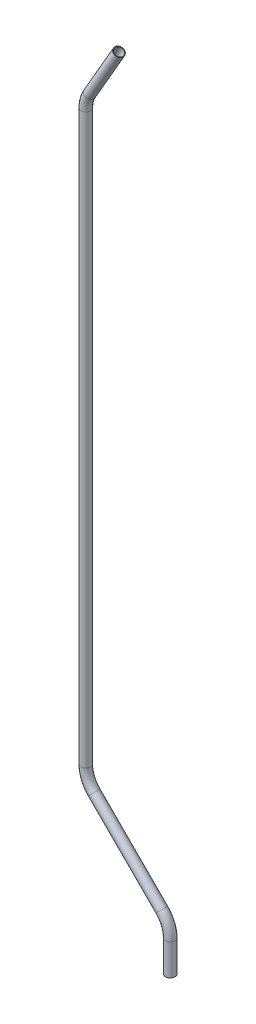
ISO-10303-21;
HEADER;
FILE_DESCRIPTION(('STEP AP214'),'2;1');
FILE_NAME('part.step','',(''),(''),'','','');
FILE_SCHEMA(('AUTOMOTIVE_DESIGN { 1 0 10303 214 1 1 1 1 }'));
ENDSEC;
DATA;
#1=APPLICATION_CONTEXT('core data for automotive mechanical design processes');
#2=APPLICATION_PROTOCOL_DEFINITION('international standard','automotive_design',2000,#1);
#3=PRODUCT_CONTEXT('',#1,'mechanical');
#4=PRODUCT('Part','Part','',(#3));
#5=PRODUCT_RELATED_PRODUCT_CATEGORY('part','',(#4));
#6=PRODUCT_DEFINITION_FORMATION('','',#4);
#7=PRODUCT_DEFINITION_CONTEXT('part definition',#1,'design');
#8=PRODUCT_DEFINITION('design','',#6,#7);
#9=PRODUCT_DEFINITION_SHAPE('','',#8);
#10=(LENGTH_UNIT() NAMED_UNIT(*) SI_UNIT(.MILLI.,.METRE.));
#11=(NAMED_UNIT(*) PLANE_ANGLE_UNIT() SI_UNIT($,.RADIAN.));
#12=(NAMED_UNIT(*) SI_UNIT($,.STERADIAN.) SOLID_ANGLE_UNIT());
#13=UNCERTAINTY_MEASURE_WITH_UNIT(LENGTH_MEASURE(1.E-05),#10,'distance_accuracy_value','');
#14=(GEOMETRIC_REPRESENTATION_CONTEXT(3) GLOBAL_UNCERTAINTY_ASSIGNED_CONTEXT((#13)) GLOBAL_UNIT_ASSIGNED_CONTEXT((#10,
#11,#12)) REPRESENTATION_CONTEXT('',''));
#15=CARTESIAN_POINT('',(0.,0.,0.));
#16=DIRECTION('',(0.,0.,1.));
#17=DIRECTION('',(1.,0.,0.));
#18=AXIS2_PLACEMENT_3D('',#15,#16,#17);
#19=CARTESIAN_POINT('',(-67.7659094877504,769.253486726415,0.));
#20=DIRECTION('',(-0.500000000000001,-0.866025403784438,0.));
#21=DIRECTION('',(0.866025403784438,-0.500000000000001,0.));
#22=AXIS2_PLACEMENT_3D('',#19,#20,#21);
#23=CYLINDRICAL_SURFACE('',#22,6.35);
#24=CARTESIAN_POINT('',(-106.655567884187,701.89462249479,0.));
#25=DIRECTION('',(0.500000000000001,0.866025403784438,0.));
#26=DIRECTION('',(0.,0.,1.));
#27=AXIS2_PLACEMENT_3D('',#24,#25,#26);
#28=CIRCLE('',#27,6.35);
#29=CARTESIAN_POINT('',(-112.154829198218,705.06962249479,0.));
#30=VERTEX_POINT('',#29);
#31=EDGE_CURVE('E65',#30,#30,#28,.T.);
#32=ORIENTED_EDGE('',*,*,#31,.T.);
#33=EDGE_LOOP('',(#32));
#34=FACE_BOUND('',#33,.T.);
#35=CARTESIAN_POINT('',(-67.7659094877504,769.253486726415,0.));
#36=DIRECTION('',(0.500000000000001,0.866025403784438,0.));
#37=DIRECTION('',(0.,0.,1.));
#38=AXIS2_PLACEMENT_3D('',#35,#36,#37);
#39=CIRCLE('',#38,6.35);
#40=CARTESIAN_POINT('',(-67.7659094877504,769.253486726415,6.35));
#41=VERTEX_POINT('',#40);
#42=EDGE_CURVE('E61',#41,#41,#39,.T.);
#43=ORIENTED_EDGE('',*,*,#42,.F.);
#44=EDGE_LOOP('',(#43));
#45=FACE_BOUND('',#44,.T.);
#46=ADVANCED_FACE('F37',(#34,#45),#23,.T.);
#47=CARTESIAN_POINT('',(-73.66,682.84462249479,0.));
#48=DIRECTION('',(0.,0.,1.));
#49=DIRECTION('',(1.,0.,0.));
#50=AXIS2_PLACEMENT_3D('',#47,#48,#49);
#51=TOROIDAL_SURFACE('',#50,38.1,6.35);
#52=CARTESIAN_POINT('',(-111.76,682.84462249479,0.));
#53=DIRECTION('',(0.,1.,0.));
#54=DIRECTION('',(0.,0.,1.));
#55=AXIS2_PLACEMENT_3D('',#52,#53,#54);
#56=CIRCLE('',#55,6.35);
#57=CARTESIAN_POINT('',(-118.11,682.84462249479,0.));
#58=VERTEX_POINT('',#57);
#59=EDGE_CURVE('E69',#58,#58,#56,.T.);
#60=CARTESIAN_POINT('',(-73.66,682.84462249479,0.));
#61=DIRECTION('',(0.,0.,1.));
#62=DIRECTION('',(1.,0.,0.));
#63=AXIS2_PLACEMENT_3D('',#60,#61,#62);
#64=CIRCLE('',#63,44.45);
#65=EDGE_CURVE('',#30,#58,#64,.T.);
#66=ORIENTED_EDGE('',*,*,#31,.F.);
#67=ORIENTED_EDGE('',*,*,#59,.T.);
#68=ORIENTED_EDGE('',*,*,#65,.T.);
#69=ORIENTED_EDGE('',*,*,#65,.F.);
#70=EDGE_LOOP('',(#66,#68,#67,#69));
#71=FACE_BOUND('',#70,.T.);
#72=ADVANCED_FACE('F122',(#71),#51,.T.);
#73=CARTESIAN_POINT('',(-111.76,682.844622494789,0.));
#74=DIRECTION('',(0.,-1.,0.));
#75=DIRECTION('',(0.,0.,-1.));
#76=AXIS2_PLACEMENT_3D('',#73,#74,#75);
#77=CYLINDRICAL_SURFACE('',#76,6.35);
#78=CARTESIAN_POINT('',(-111.76,-68.9465132735846,0.));
#79=DIRECTION('',(0.,1.,0.));
#80=DIRECTION('',(0.,0.,1.));
#81=AXIS2_PLACEMENT_3D('',#78,#79,#80);
#82=CIRCLE('',#81,6.35);
#83=CARTESIAN_POINT('',(-118.11,-68.9465132735846,0.));
#84=VERTEX_POINT('',#83);
#85=EDGE_CURVE('E73',#84,#84,#82,.T.);
#86=ORIENTED_EDGE('',*,*,#85,.T.);
#87=EDGE_LOOP('',(#86));
#88=FACE_BOUND('',#87,.T.);
#89=ORIENTED_EDGE('',*,*,#59,.F.);
#90=EDGE_LOOP('',(#89));
#91=FACE_BOUND('',#90,.T.);
#92=ADVANCED_FACE('F126',(#88,#91),#77,.T.);
#93=CARTESIAN_POINT('',(-73.66,-68.9465132735846,0.));
#94=DIRECTION('',(0.,0.,1.));
#95=DIRECTION('',(1.,0.,0.));
#96=AXIS2_PLACEMENT_3D('',#93,#94,#95);
#97=TOROIDAL_SURFACE('',#96,38.1,6.35);
#98=CARTESIAN_POINT('',(-100.600768363208,-95.8872816367921,0.));
#99=DIRECTION('',(-0.707106781186546,0.707106781186549,0.));
#100=DIRECTION('',(0.,0.,1.));
#101=AXIS2_PLACEMENT_3D('',#98,#99,#100);
#102=CIRCLE('',#101,6.35);
#103=CARTESIAN_POINT('',(-105.090896423742,-100.377409697327,0.));
#104=VERTEX_POINT('',#103);
#105=EDGE_CURVE('E77',#104,#104,#102,.T.);
#106=CARTESIAN_POINT('',(-73.66,-68.9465132735846,0.));
#107=DIRECTION('',(0.,0.,1.));
#108=DIRECTION('',(1.,0.,0.));
#109=AXIS2_PLACEMENT_3D('',#106,#107,#108);
#110=CIRCLE('',#109,44.45);
#111=EDGE_CURVE('',#84,#104,#110,.T.);
#112=ORIENTED_EDGE('',*,*,#85,.F.);
#113=ORIENTED_EDGE('',*,*,#105,.T.);
#114=ORIENTED_EDGE('',*,*,#111,.T.);
#115=ORIENTED_EDGE('',*,*,#111,.F.);
#116=EDGE_LOOP('',(#112,#114,#113,#115));
#117=FACE_BOUND('',#116,.T.);
#118=ADVANCED_FACE('F130',(#117),#97,.T.);
#119=CARTESIAN_POINT('',(-100.600768363208,-95.8872816367921,0.));
#120=DIRECTION('',(0.707106781186546,-0.707106781186549,0.));
#121=DIRECTION('',(0.707106781186549,0.707106781186546,0.));
#122=AXIS2_PLACEMENT_3D('',#119,#120,#121);
#123=CYLINDRICAL_SURFACE('',#122,6.35);
#124=CARTESIAN_POINT('',(-11.1592316367925,-185.328818363207,0.));
#125=DIRECTION('',(-0.707106781186546,0.707106781186549,0.));
#126=DIRECTION('',(0.,0.,1.));
#127=AXIS2_PLACEMENT_3D('',#124,#125,#126);
#128=CIRCLE('',#127,6.35);
#129=CARTESIAN_POINT('',(-6.66910357625795,-180.838690302673,0.));
#130=VERTEX_POINT('',#129);
#131=EDGE_CURVE('E80',#130,#130,#128,.T.);
#132=ORIENTED_EDGE('',*,*,#131,.T.);
#133=EDGE_LOOP('',(#132));
#134=FACE_BOUND('',#133,.T.);
#135=ORIENTED_EDGE('',*,*,#105,.F.);
#136=EDGE_LOOP('',(#135));
#137=FACE_BOUND('',#136,.T.);
#138=ADVANCED_FACE('F102',(#134,#137),#123,.T.);
#139=CARTESIAN_POINT('',(-38.1,-212.269586726415,0.));
#140=DIRECTION('',(0.,0.,-1.));
#141=DIRECTION('',(-1.,0.,0.));
#142=AXIS2_PLACEMENT_3D('',#139,#140,#141);
#143=TOROIDAL_SURFACE('',#142,38.1,6.35);
#144=CARTESIAN_POINT('',(0.,-212.269586726415,0.));
#145=DIRECTION('',(0.,1.,0.));
#146=DIRECTION('',(0.,0.,1.));
#147=AXIS2_PLACEMENT_3D('',#144,#145,#146);
#148=CIRCLE('',#147,6.35);
#149=CARTESIAN_POINT('',(6.34999999999997,-212.269586726415,0.));
#150=VERTEX_POINT('',#149);
#151=EDGE_CURVE('E41',#150,#150,#148,.T.);
#152=CARTESIAN_POINT('',(-38.1,-212.269586726415,0.));
#153=DIRECTION('',(0.,0.,-1.));
#154=DIRECTION('',(-1.,0.,0.));
#155=AXIS2_PLACEMENT_3D('',#152,#153,#154);
#156=CIRCLE('',#155,44.45);
#157=EDGE_CURVE('',#130,#150,#156,.T.);
#158=ORIENTED_EDGE('',*,*,#131,.F.);
#159=ORIENTED_EDGE('',*,*,#151,.T.);
#160=ORIENTED_EDGE('',*,*,#157,.T.);
#161=ORIENTED_EDGE('',*,*,#157,.F.);
#162=EDGE_LOOP('',(#158,#160,#159,#161));
#163=FACE_BOUND('',#162,.T.);
#164=ADVANCED_FACE('F89',(#163),#143,.T.);
#165=CARTESIAN_POINT('',(0.,-212.269586726415,0.));
#166=DIRECTION('',(0.,-1.,0.));
#167=DIRECTION('',(1.,0.,0.));
#168=AXIS2_PLACEMENT_3D('',#165,#166,#167);
#169=CYLINDRICAL_SURFACE('',#168,6.35);
#170=CARTESIAN_POINT('',(0.,-253.63805,0.));
#171=DIRECTION('',(0.,1.,0.));
#172=DIRECTION('',(0.,0.,1.));
#173=AXIS2_PLACEMENT_3D('',#170,#171,#172);
#174=CIRCLE('',#173,6.35);
#175=CARTESIAN_POINT('',(0.,-253.63805,6.35));
#176=VERTEX_POINT('',#175);
#177=EDGE_CURVE('E56',#176,#176,#174,.T.);
#178=ORIENTED_EDGE('',*,*,#177,.T.);
#179=EDGE_LOOP('',(#178));
#180=FACE_BOUND('',#179,.T.);
#181=ORIENTED_EDGE('',*,*,#151,.F.);
#182=EDGE_LOOP('',(#181));
#183=FACE_BOUND('',#182,.T.);
#184=ADVANCED_FACE('F39',(#180,#183),#169,.T.);
#185=CARTESIAN_POINT('',(-67.7659094877504,769.253486726415,0.));
#186=DIRECTION('',(0.500000000000001,0.866025403784438,0.));
#187=DIRECTION('',(0.,0.,1.));
#188=AXIS2_PLACEMENT_3D('',#185,#186,#187);
#189=PLANE('',#188);
#190=CARTESIAN_POINT('',(-67.7659094877504,769.253486726415,0.));
#191=DIRECTION('',(0.500000000000001,0.866025403784438,0.));
#192=DIRECTION('',(0.,0.,1.));
#193=AXIS2_PLACEMENT_3D('',#190,#191,#192);
#194=CIRCLE('',#193,5.5372);
#195=CARTESIAN_POINT('',(-67.7659094877504,769.253486726415,5.5372));
#196=VERTEX_POINT('',#195);
#197=EDGE_CURVE('E60',#196,#196,#194,.F.);
#198=ORIENTED_EDGE('',*,*,#197,.T.);
#199=EDGE_LOOP('',(#198));
#200=FACE_BOUND('',#199,.T.);
#201=ORIENTED_EDGE('',*,*,#42,.T.);
#202=EDGE_LOOP('',(#201));
#203=FACE_BOUND('',#202,.T.);
#204=ADVANCED_FACE('F93',(#200,#203),#189,.T.);
#205=CARTESIAN_POINT('',(0.,-253.63805,0.));
#206=DIRECTION('',(0.,1.,0.));
#207=DIRECTION('',(0.,0.,1.));
#208=AXIS2_PLACEMENT_3D('',#205,#206,#207);
#209=PLANE('',#208);
#210=CARTESIAN_POINT('',(0.,-253.63805,0.));
#211=DIRECTION('',(0.,1.,0.));
#212=DIRECTION('',(0.,0.,1.));
#213=AXIS2_PLACEMENT_3D('',#210,#211,#212);
#214=CIRCLE('',#213,5.5372);
#215=CARTESIAN_POINT('',(0.,-253.63805,5.5372));
#216=VERTEX_POINT('',#215);
#217=EDGE_CURVE('E10',#216,#216,#214,.F.);
#218=ORIENTED_EDGE('',*,*,#217,.F.);
#219=EDGE_LOOP('',(#218));
#220=FACE_BOUND('',#219,.T.);
#221=ORIENTED_EDGE('',*,*,#177,.F.);
#222=EDGE_LOOP('',(#221));
#223=FACE_BOUND('',#222,.T.);
#224=ADVANCED_FACE('F99',(#220,#223),#209,.F.);
#225=CARTESIAN_POINT('',(-67.7659094877504,769.253486726415,0.));
#226=DIRECTION('',(-0.500000000000001,-0.866025403784438,0.));
#227=DIRECTION('',(0.866025403784438,-0.500000000000001,0.));
#228=AXIS2_PLACEMENT_3D('',#225,#226,#227);
#229=CYLINDRICAL_SURFACE('',#228,5.5372);
#230=CARTESIAN_POINT('',(-106.655567884187,701.89462249479,0.));
#231=DIRECTION('',(0.500000000000001,0.866025403784438,0.));
#232=DIRECTION('',(0.,0.,1.));
#233=AXIS2_PLACEMENT_3D('',#230,#231,#232);
#234=CIRCLE('',#233,5.5372);
#235=CARTESIAN_POINT('',(-111.450923750022,704.66322249479,0.));
#236=VERTEX_POINT('',#235);
#237=EDGE_CURVE('E250',#236,#236,#234,.F.);
#238=ORIENTED_EDGE('',*,*,#237,.T.);
#239=EDGE_LOOP('',(#238));
#240=FACE_BOUND('',#239,.T.);
#241=ORIENTED_EDGE('',*,*,#197,.F.);
#242=EDGE_LOOP('',(#241));
#243=FACE_BOUND('',#242,.T.);
#244=ADVANCED_FACE('F117',(#240,#243),#229,.F.);
#245=CARTESIAN_POINT('',(-73.66,682.84462249479,0.));
#246=DIRECTION('',(0.,0.,1.));
#247=DIRECTION('',(1.,0.,0.));
#248=AXIS2_PLACEMENT_3D('',#245,#246,#247);
#249=TOROIDAL_SURFACE('',#248,38.1,5.5372);
#250=CARTESIAN_POINT('',(-111.76,682.84462249479,0.));
#251=DIRECTION('',(0.,1.,0.));
#252=DIRECTION('',(0.,0.,1.));
#253=AXIS2_PLACEMENT_3D('',#250,#251,#252);
#254=CIRCLE('',#253,5.5372);
#255=CARTESIAN_POINT('',(-117.2972,682.84462249479,0.));
#256=VERTEX_POINT('',#255);
#257=EDGE_CURVE('E244',#256,#256,#254,.F.);
#258=CARTESIAN_POINT('',(-73.66,682.84462249479,0.));
#259=DIRECTION('',(0.,0.,1.));
#260=DIRECTION('',(1.,0.,0.));
#261=AXIS2_PLACEMENT_3D('',#258,#259,#260);
#262=CIRCLE('',#261,43.6372);
#263=EDGE_CURVE('',#236,#256,#262,.T.);
#264=ORIENTED_EDGE('',*,*,#237,.F.);
#265=ORIENTED_EDGE('',*,*,#257,.T.);
#266=ORIENTED_EDGE('',*,*,#263,.T.);
#267=ORIENTED_EDGE('',*,*,#263,.F.);
#268=EDGE_LOOP('',(#264,#266,#265,#267));
#269=FACE_BOUND('',#268,.T.);
#270=ADVANCED_FACE('F180',(#269),#249,.F.);
#271=CARTESIAN_POINT('',(-111.76,682.844622494789,0.));
#272=DIRECTION('',(0.,-1.,0.));
#273=DIRECTION('',(0.,0.,-1.));
#274=AXIS2_PLACEMENT_3D('',#271,#272,#273);
#275=CYLINDRICAL_SURFACE('',#274,5.5372);
#276=CARTESIAN_POINT('',(-111.76,-68.9465132735846,0.));
#277=DIRECTION('',(0.,1.,0.));
#278=DIRECTION('',(0.,0.,1.));
#279=AXIS2_PLACEMENT_3D('',#276,#277,#278);
#280=CIRCLE('',#279,5.5372);
#281=CARTESIAN_POINT('',(-117.2972,-68.9465132735846,0.));
#282=VERTEX_POINT('',#281);
#283=EDGE_CURVE('E239',#282,#282,#280,.F.);
#284=ORIENTED_EDGE('',*,*,#283,.T.);
#285=EDGE_LOOP('',(#284));
#286=FACE_BOUND('',#285,.T.);
#287=ORIENTED_EDGE('',*,*,#257,.F.);
#288=EDGE_LOOP('',(#287));
#289=FACE_BOUND('',#288,.T.);
#290=ADVANCED_FACE('F190',(#286,#289),#275,.F.);
#291=CARTESIAN_POINT('',(-73.66,-68.9465132735846,0.));
#292=DIRECTION('',(0.,0.,1.));
#293=DIRECTION('',(1.,0.,0.));
#294=AXIS2_PLACEMENT_3D('',#291,#292,#293);
#295=TOROIDAL_SURFACE('',#294,38.1,5.5372);
#296=CARTESIAN_POINT('',(-100.600768363208,-95.8872816367921,0.));
#297=DIRECTION('',(-0.707106781186546,0.707106781186549,0.));
#298=DIRECTION('',(0.,0.,1.));
#299=AXIS2_PLACEMENT_3D('',#296,#297,#298);
#300=CIRCLE('',#299,5.5372);
#301=CARTESIAN_POINT('',(-104.516160031994,-99.8026733055782,0.));
#302=VERTEX_POINT('',#301);
#303=EDGE_CURVE('E237',#302,#302,#300,.F.);
#304=CARTESIAN_POINT('',(-73.66,-68.9465132735846,0.));
#305=DIRECTION('',(0.,0.,1.));
#306=DIRECTION('',(1.,0.,0.));
#307=AXIS2_PLACEMENT_3D('',#304,#305,#306);
#308=CIRCLE('',#307,43.6372);
#309=EDGE_CURVE('',#282,#302,#308,.T.);
#310=ORIENTED_EDGE('',*,*,#283,.F.);
#311=ORIENTED_EDGE('',*,*,#303,.T.);
#312=ORIENTED_EDGE('',*,*,#309,.T.);
#313=ORIENTED_EDGE('',*,*,#309,.F.);
#314=EDGE_LOOP('',(#310,#312,#311,#313));
#315=FACE_BOUND('',#314,.T.);
#316=ADVANCED_FACE('F200',(#315),#295,.F.);
#317=CARTESIAN_POINT('',(-100.600768363208,-95.8872816367921,0.));
#318=DIRECTION('',(0.707106781186546,-0.707106781186549,0.));
#319=DIRECTION('',(0.707106781186549,0.707106781186546,0.));
#320=AXIS2_PLACEMENT_3D('',#317,#318,#319);
#321=CYLINDRICAL_SURFACE('',#320,5.5372);
#322=CARTESIAN_POINT('',(-11.1592316367925,-185.328818363207,0.));
#323=DIRECTION('',(-0.707106781186546,0.707106781186549,0.));
#324=DIRECTION('',(0.,0.,1.));
#325=AXIS2_PLACEMENT_3D('',#322,#323,#324);
#326=CIRCLE('',#325,5.5372);
#327=CARTESIAN_POINT('',(-7.24383996800638,-181.413426694421,0.));
#328=VERTEX_POINT('',#327);
#329=EDGE_CURVE('E52',#328,#328,#326,.F.);
#330=ORIENTED_EDGE('',*,*,#329,.T.);
#331=EDGE_LOOP('',(#330));
#332=FACE_BOUND('',#331,.T.);
#333=ORIENTED_EDGE('',*,*,#303,.F.);
#334=EDGE_LOOP('',(#333));
#335=FACE_BOUND('',#334,.T.);
#336=ADVANCED_FACE('F110',(#332,#335),#321,.F.);
#337=CARTESIAN_POINT('',(-38.1,-212.269586726415,0.));
#338=DIRECTION('',(0.,0.,-1.));
#339=DIRECTION('',(-1.,0.,0.));
#340=AXIS2_PLACEMENT_3D('',#337,#338,#339);
#341=TOROIDAL_SURFACE('',#340,38.1,5.5372);
#342=CARTESIAN_POINT('',(0.,-212.269586726415,0.));
#343=DIRECTION('',(0.,1.,0.));
#344=DIRECTION('',(0.,0.,1.));
#345=AXIS2_PLACEMENT_3D('',#342,#343,#344);
#346=CIRCLE('',#345,5.5372);
#347=CARTESIAN_POINT('',(5.53719999999998,-212.269586726415,0.));
#348=VERTEX_POINT('',#347);
#349=EDGE_CURVE('E46',#348,#348,#346,.F.);
#350=CARTESIAN_POINT('',(-38.1,-212.269586726415,0.));
#351=DIRECTION('',(0.,0.,-1.));
#352=DIRECTION('',(-1.,0.,0.));
#353=AXIS2_PLACEMENT_3D('',#350,#351,#352);
#354=CIRCLE('',#353,43.6372);
#355=EDGE_CURVE('',#328,#348,#354,.T.);
#356=ORIENTED_EDGE('',*,*,#329,.F.);
#357=ORIENTED_EDGE('',*,*,#349,.T.);
#358=ORIENTED_EDGE('',*,*,#355,.T.);
#359=ORIENTED_EDGE('',*,*,#355,.F.);
#360=EDGE_LOOP('',(#356,#358,#357,#359));
#361=FACE_BOUND('',#360,.T.);
#362=ADVANCED_FACE('F105',(#361),#341,.F.);
#363=CARTESIAN_POINT('',(0.,-212.269586726415,0.));
#364=DIRECTION('',(0.,-1.,0.));
#365=DIRECTION('',(1.,0.,0.));
#366=AXIS2_PLACEMENT_3D('',#363,#364,#365);
#367=CYLINDRICAL_SURFACE('',#366,5.5372);
#368=ORIENTED_EDGE('',*,*,#217,.T.);
#369=EDGE_LOOP('',(#368));
#370=FACE_BOUND('',#369,.T.);
#371=ORIENTED_EDGE('',*,*,#349,.F.);
#372=EDGE_LOOP('',(#371));
#373=FACE_BOUND('',#372,.T.);
#374=ADVANCED_FACE('F103',(#370,#373),#367,.F.);
#375=CLOSED_SHELL('',(#46,#72,#92,#118,#138,#164,#184,#204,#224,#244,#270,#290,#316,#336,#362,#374));
#376=MANIFOLD_SOLID_BREP('B2',#375);
#377=ADVANCED_BREP_SHAPE_REPRESENTATION('',(#18,#376),#14);
#378=SHAPE_DEFINITION_REPRESENTATION(#9,#377);
ENDSEC;
END-ISO-10303-21;
